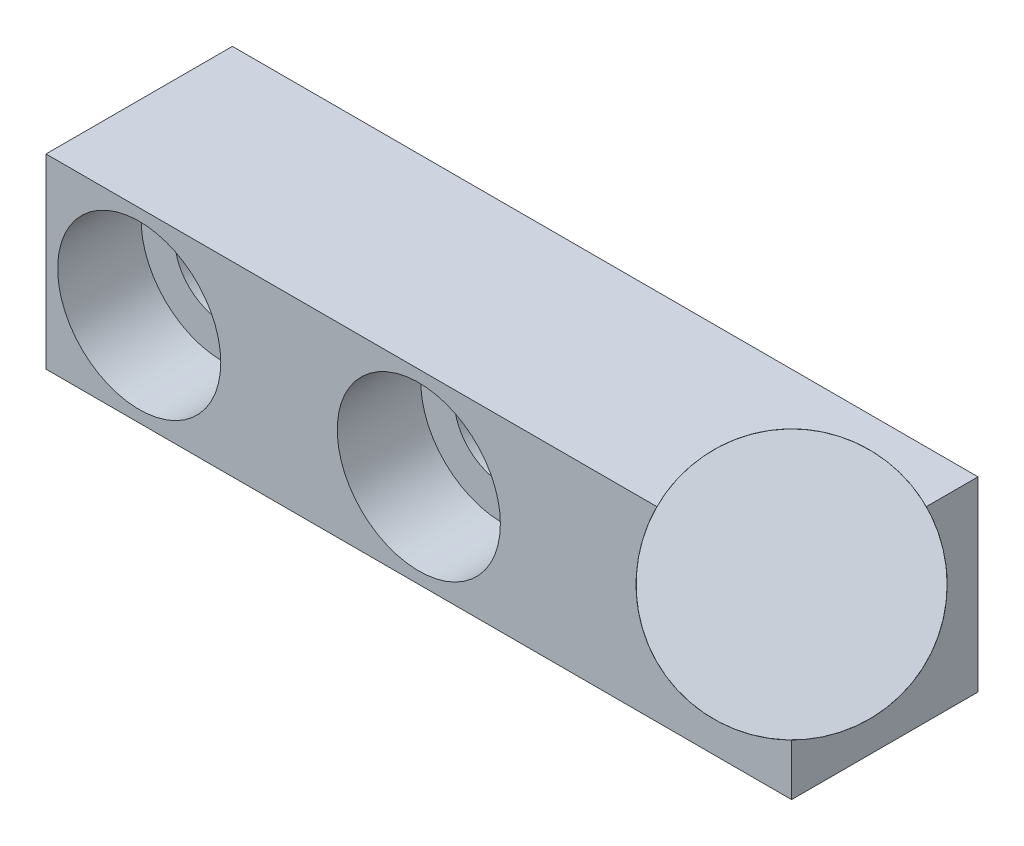
ISO-10303-21;
HEADER;
FILE_DESCRIPTION(('STEP AP214'),'2;1');
FILE_NAME('part.step','',(''),(''),'','','');
FILE_SCHEMA(('AUTOMOTIVE_DESIGN { 1 0 10303 214 1 1 1 1 }'));
ENDSEC;
DATA;
#1=APPLICATION_CONTEXT('core data for automotive mechanical design processes');
#2=APPLICATION_PROTOCOL_DEFINITION('international standard','automotive_design',2000,#1);
#3=PRODUCT_CONTEXT('',#1,'mechanical');
#4=PRODUCT('Part','Part','',(#3));
#5=PRODUCT_RELATED_PRODUCT_CATEGORY('part','',(#4));
#6=PRODUCT_DEFINITION_FORMATION('','',#4);
#7=PRODUCT_DEFINITION_CONTEXT('part definition',#1,'design');
#8=PRODUCT_DEFINITION('design','',#6,#7);
#9=PRODUCT_DEFINITION_SHAPE('','',#8);
#10=(LENGTH_UNIT() NAMED_UNIT(*) SI_UNIT(.MILLI.,.METRE.));
#11=(NAMED_UNIT(*) PLANE_ANGLE_UNIT() SI_UNIT($,.RADIAN.));
#12=(NAMED_UNIT(*) SI_UNIT($,.STERADIAN.) SOLID_ANGLE_UNIT());
#13=UNCERTAINTY_MEASURE_WITH_UNIT(LENGTH_MEASURE(1.E-05),#10,'distance_accuracy_value','');
#14=(GEOMETRIC_REPRESENTATION_CONTEXT(3) GLOBAL_UNCERTAINTY_ASSIGNED_CONTEXT((#13)) GLOBAL_UNIT_ASSIGNED_CONTEXT((#10,
#11,#12)) REPRESENTATION_CONTEXT('',''));
#15=CARTESIAN_POINT('',(0.,0.,0.));
#16=DIRECTION('',(0.,0.,1.));
#17=DIRECTION('',(1.,0.,0.));
#18=AXIS2_PLACEMENT_3D('',#15,#16,#17);
#19=CARTESIAN_POINT('',(-12.7,-3.175,6.35));
#20=DIRECTION('',(-1.,0.,0.));
#21=DIRECTION('',(0.,0.,1.));
#22=AXIS2_PLACEMENT_3D('',#19,#20,#21);
#23=PLANE('',#22);
#24=DIRECTION('',(0.,1.,0.));
#25=VECTOR('',#24,1.);
#26=CARTESIAN_POINT('',(-12.7,-3.175,0.));
#27=LINE('',#26,#25);
#28=CARTESIAN_POINT('',(-12.7,-3.175,0.));
#29=VERTEX_POINT('',#28);
#30=CARTESIAN_POINT('',(-12.7,3.175,0.));
#31=VERTEX_POINT('',#30);
#32=EDGE_CURVE('E121',#29,#31,#27,.T.);
#33=ORIENTED_EDGE('',*,*,#32,.F.);
#34=DIRECTION('',(0.,0.,-1.));
#35=VECTOR('',#34,1.);
#36=CARTESIAN_POINT('',(-12.7,-3.175,6.35));
#37=LINE('',#36,#35);
#38=CARTESIAN_POINT('',(-12.7,-3.175,6.35));
#39=VERTEX_POINT('',#38);
#40=EDGE_CURVE('E98',#39,#29,#37,.T.);
#41=ORIENTED_EDGE('',*,*,#40,.F.);
#42=DIRECTION('',(0.,1.,0.));
#43=VECTOR('',#42,1.);
#44=CARTESIAN_POINT('',(-12.7,-3.175,6.35));
#45=LINE('',#44,#43);
#46=CARTESIAN_POINT('',(-12.7,3.175,6.35));
#47=VERTEX_POINT('',#46);
#48=EDGE_CURVE('E139',#39,#47,#45,.T.);
#49=ORIENTED_EDGE('',*,*,#48,.T.);
#50=DIRECTION('',(0.,0.,-1.));
#51=VECTOR('',#50,1.);
#52=CARTESIAN_POINT('',(-12.7,3.175,6.35));
#53=LINE('',#52,#51);
#54=EDGE_CURVE('E146',#47,#31,#53,.T.);
#55=ORIENTED_EDGE('',*,*,#54,.T.);
#56=EDGE_LOOP('',(#33,#41,#49,#55));
#57=FACE_BOUND('',#56,.T.);
#58=ADVANCED_FACE('F33',(#57),#23,.T.);
#59=CARTESIAN_POINT('',(-12.7,-3.175,6.35));
#60=DIRECTION('',(0.,1.,0.));
#61=DIRECTION('',(0.,0.,1.));
#62=AXIS2_PLACEMENT_3D('',#59,#60,#61);
#63=PLANE('',#62);
#64=DIRECTION('',(0.707106781186547,0.,-0.707106781186548));
#65=VECTOR('',#64,1.);
#66=CARTESIAN_POINT('',(-1.77433518262806,-3.175,17.2756648173719));
#67=LINE('',#66,#65);
#68=CARTESIAN_POINT('',(10.7276035018956,-3.175,4.77372613284826));
#69=VERTEX_POINT('',#68);
#70=CARTESIAN_POINT('',(11.1237261328483,-3.175,4.3776035018956));
#71=VERTEX_POINT('',#70);
#72=EDGE_CURVE('E46',#69,#71,#67,.T.);
#73=ORIENTED_EDGE('',*,*,#72,.F.);
#74=CARTESIAN_POINT('',(6.35,-3.175,0.));
#75=DIRECTION('',(0.,1.,0.));
#76=DIRECTION('',(0.707106781186548,0.,0.707106781186547));
#77=AXIS2_PLACEMENT_3D('',#74,#75,#76);
#78=ELLIPSE('',#77,6.4891283505568,3.7465);
#79=EDGE_CURVE('E187',#69,#71,#78,.T.);
#80=ORIENTED_EDGE('',*,*,#79,.T.);
#81=EDGE_LOOP('',(#73,#80));
#82=FACE_BOUND('',#81,.T.);
#83=DIRECTION('',(1.,0.,0.));
#84=VECTOR('',#83,1.);
#85=CARTESIAN_POINT('',(-12.7,-3.175,0.));
#86=LINE('',#85,#84);
#87=CARTESIAN_POINT('',(12.7,-3.175,0.));
#88=VERTEX_POINT('',#87);
#89=EDGE_CURVE('E125',#29,#88,#86,.T.);
#90=ORIENTED_EDGE('',*,*,#89,.T.);
#91=DIRECTION('',(0.,0.,-1.));
#92=VECTOR('',#91,1.);
#93=CARTESIAN_POINT('',(12.7,-3.175,6.35));
#94=LINE('',#93,#92);
#95=CARTESIAN_POINT('',(12.7,-3.175,6.35));
#96=VERTEX_POINT('',#95);
#97=EDGE_CURVE('E141',#96,#88,#94,.T.);
#98=ORIENTED_EDGE('',*,*,#97,.F.);
#99=DIRECTION('',(1.,0.,0.));
#100=VECTOR('',#99,1.);
#101=CARTESIAN_POINT('',(-12.7,-3.175,6.35));
#102=LINE('',#101,#100);
#103=EDGE_CURVE('E133',#39,#96,#102,.T.);
#104=ORIENTED_EDGE('',*,*,#103,.F.);
#105=ORIENTED_EDGE('',*,*,#40,.T.);
#106=EDGE_LOOP('',(#90,#98,#104,#105));
#107=FACE_BOUND('',#106,.T.);
#108=ADVANCED_FACE('F181',(#82,#107),#63,.F.);
#109=CARTESIAN_POINT('',(12.7,-3.175,6.35));
#110=DIRECTION('',(-1.,0.,0.));
#111=DIRECTION('',(0.,0.,1.));
#112=AXIS2_PLACEMENT_3D('',#109,#110,#111);
#113=PLANE('',#112);
#114=DIRECTION('',(0.,0.,-1.));
#115=VECTOR('',#114,1.);
#116=CARTESIAN_POINT('',(12.7,3.175,6.35));
#117=LINE('',#116,#115);
#118=CARTESIAN_POINT('',(12.7,3.175,1.76149333933141));
#119=VERTEX_POINT('',#118);
#120=CARTESIAN_POINT('',(12.7,3.175,0.));
#121=VERTEX_POINT('',#120);
#122=EDGE_CURVE('E144',#119,#121,#117,.T.);
#123=ORIENTED_EDGE('',*,*,#122,.F.);
#124=CARTESIAN_POINT('',(12.7,3.175,6.35));
#125=DIRECTION('',(-1.,0.,0.));
#126=DIRECTION('',(0.,0.707106781186548,0.707106781186548));
#127=AXIS2_PLACEMENT_3D('',#124,#125,#126);
#128=ELLIPSE('',#127,6.4891283505568,3.7465);
#129=CARTESIAN_POINT('',(12.7,-1.41350666066859,6.35));
#130=VERTEX_POINT('',#129);
#131=EDGE_CURVE('E186',#119,#130,#128,.T.);
#132=ORIENTED_EDGE('',*,*,#131,.T.);
#133=DIRECTION('',(0.,1.,0.));
#134=VECTOR('',#133,1.);
#135=CARTESIAN_POINT('',(12.7,-3.175,6.35));
#136=LINE('',#135,#134);
#137=EDGE_CURVE('E172',#96,#130,#136,.T.);
#138=ORIENTED_EDGE('',*,*,#137,.F.);
#139=ORIENTED_EDGE('',*,*,#97,.T.);
#140=DIRECTION('',(0.,1.,0.));
#141=VECTOR('',#140,1.);
#142=CARTESIAN_POINT('',(12.7,-3.175,0.));
#143=LINE('',#142,#141);
#144=EDGE_CURVE('E128',#88,#121,#143,.T.);
#145=ORIENTED_EDGE('',*,*,#144,.T.);
#146=EDGE_LOOP('',(#123,#132,#138,#139,#145));
#147=FACE_BOUND('',#146,.T.);
#148=ADVANCED_FACE('F185',(#147),#113,.F.);
#149=CARTESIAN_POINT('',(-12.7,3.175,6.35));
#150=DIRECTION('',(0.,1.,0.));
#151=DIRECTION('',(0.,0.,1.));
#152=AXIS2_PLACEMENT_3D('',#149,#150,#151);
#153=PLANE('',#152);
#154=CARTESIAN_POINT('',(12.7,3.175,6.35));
#155=DIRECTION('',(0.,1.,0.));
#156=DIRECTION('',(0.707106781186548,0.,0.707106781186547));
#157=AXIS2_PLACEMENT_3D('',#154,#155,#156);
#158=ELLIPSE('',#157,6.4891283505568,3.7465);
#159=CARTESIAN_POINT('',(8.11149333933141,3.175,6.35));
#160=VERTEX_POINT('',#159);
#161=EDGE_CURVE('E54',#119,#160,#158,.T.);
#162=ORIENTED_EDGE('',*,*,#161,.F.);
#163=ORIENTED_EDGE('',*,*,#122,.T.);
#164=DIRECTION('',(1.,0.,0.));
#165=VECTOR('',#164,1.);
#166=CARTESIAN_POINT('',(-12.7,3.175,0.));
#167=LINE('',#166,#165);
#168=EDGE_CURVE('E124',#31,#121,#167,.T.);
#169=ORIENTED_EDGE('',*,*,#168,.F.);
#170=ORIENTED_EDGE('',*,*,#54,.F.);
#171=DIRECTION('',(1.,0.,0.));
#172=VECTOR('',#171,1.);
#173=CARTESIAN_POINT('',(-12.7,3.175,6.35));
#174=LINE('',#173,#172);
#175=EDGE_CURVE('E170',#47,#160,#174,.T.);
#176=ORIENTED_EDGE('',*,*,#175,.T.);
#177=EDGE_LOOP('',(#162,#163,#169,#170,#176));
#178=FACE_BOUND('',#177,.T.);
#179=ADVANCED_FACE('F200',(#178),#153,.T.);
#180=CARTESIAN_POINT('',(0.,0.,6.35));
#181=DIRECTION('',(0.,0.,-1.));
#182=DIRECTION('',(-1.,0.,0.));
#183=AXIS2_PLACEMENT_3D('',#180,#181,#182);
#184=PLANE('',#183);
#185=CARTESIAN_POINT('',(-9.525,0.,6.35));
#186=DIRECTION('',(0.,0.,1.));
#187=DIRECTION('',(1.,0.,0.));
#188=AXIS2_PLACEMENT_3D('',#185,#186,#187);
#189=CIRCLE('',#188,2.77875999999999);
#190=CARTESIAN_POINT('',(-6.74624000000001,0.,6.35));
#191=VERTEX_POINT('',#190);
#192=EDGE_CURVE('E160',#191,#191,#189,.T.);
#193=ORIENTED_EDGE('',*,*,#192,.F.);
#194=EDGE_LOOP('',(#193));
#195=FACE_BOUND('',#194,.T.);
#196=CARTESIAN_POINT('',(0.,0.,6.35));
#197=DIRECTION('',(0.,0.,1.));
#198=DIRECTION('',(1.,0.,0.));
#199=AXIS2_PLACEMENT_3D('',#196,#197,#198);
#200=CIRCLE('',#199,2.77875999999999);
#201=CARTESIAN_POINT('',(2.77875999999999,0.,6.35));
#202=VERTEX_POINT('',#201);
#203=EDGE_CURVE('E148',#202,#202,#200,.T.);
#204=ORIENTED_EDGE('',*,*,#203,.F.);
#205=EDGE_LOOP('',(#204));
#206=FACE_BOUND('',#205,.T.);
#207=ORIENTED_EDGE('',*,*,#137,.T.);
#208=CARTESIAN_POINT('',(12.7,3.175,6.35));
#209=DIRECTION('',(0.,0.,-1.));
#210=DIRECTION('',(0.707106781186548,0.707106781186547,0.));
#211=AXIS2_PLACEMENT_3D('',#208,#209,#210);
#212=ELLIPSE('',#211,6.4891283505568,3.7465);
#213=EDGE_CURVE('E190',#130,#160,#212,.T.);
#214=ORIENTED_EDGE('',*,*,#213,.T.);
#215=ORIENTED_EDGE('',*,*,#175,.F.);
#216=ORIENTED_EDGE('',*,*,#48,.F.);
#217=ORIENTED_EDGE('',*,*,#103,.T.);
#218=EDGE_LOOP('',(#207,#214,#215,#216,#217));
#219=FACE_BOUND('',#218,.T.);
#220=ADVANCED_FACE('F107',(#195,#206,#219),#184,.F.);
#221=CARTESIAN_POINT('',(0.,0.,0.));
#222=DIRECTION('',(0.,0.,-1.));
#223=DIRECTION('',(-1.,0.,0.));
#224=AXIS2_PLACEMENT_3D('',#221,#222,#223);
#225=PLANE('',#224);
#226=CARTESIAN_POINT('',(6.35,-3.175,0.));
#227=DIRECTION('',(0.,0.,-1.));
#228=DIRECTION('',(0.707106781186548,0.707106781186547,0.));
#229=AXIS2_PLACEMENT_3D('',#226,#227,#228);
#230=ELLIPSE('',#229,6.4891283505568,3.7465);
#231=CARTESIAN_POINT('',(10.7276035018956,1.59872613284829,0.));
#232=VERTEX_POINT('',#231);
#233=CARTESIAN_POINT('',(11.1237261328483,1.20260350189558,0.));
#234=VERTEX_POINT('',#233);
#235=EDGE_CURVE('E11',#232,#234,#230,.T.);
#236=ORIENTED_EDGE('',*,*,#235,.F.);
#237=DIRECTION('',(0.707106781186547,-0.707106781186548,0.));
#238=VECTOR('',#237,1.);
#239=CARTESIAN_POINT('',(6.16316481737193,6.16316481737193,0.));
#240=LINE('',#239,#238);
#241=EDGE_CURVE('E40',#232,#234,#240,.T.);
#242=ORIENTED_EDGE('',*,*,#241,.T.);
#243=EDGE_LOOP('',(#236,#242));
#244=FACE_BOUND('',#243,.T.);
#245=CARTESIAN_POINT('',(-9.525,0.,0.));
#246=DIRECTION('',(0.,0.,-1.));
#247=DIRECTION('',(-1.,0.,0.));
#248=AXIS2_PLACEMENT_3D('',#245,#246,#247);
#249=CIRCLE('',#248,1.63195);
#250=CARTESIAN_POINT('',(-11.15695,0.,0.));
#251=VERTEX_POINT('',#250);
#252=EDGE_CURVE('E112',#251,#251,#249,.T.);
#253=ORIENTED_EDGE('',*,*,#252,.F.);
#254=EDGE_LOOP('',(#253));
#255=FACE_BOUND('',#254,.T.);
#256=CARTESIAN_POINT('',(0.,0.,0.));
#257=DIRECTION('',(0.,0.,-1.));
#258=DIRECTION('',(-1.,0.,0.));
#259=AXIS2_PLACEMENT_3D('',#256,#257,#258);
#260=CIRCLE('',#259,1.63195);
#261=CARTESIAN_POINT('',(-1.63195,0.,0.));
#262=VERTEX_POINT('',#261);
#263=EDGE_CURVE('E116',#262,#262,#260,.T.);
#264=ORIENTED_EDGE('',*,*,#263,.F.);
#265=EDGE_LOOP('',(#264));
#266=FACE_BOUND('',#265,.T.);
#267=ORIENTED_EDGE('',*,*,#32,.T.);
#268=ORIENTED_EDGE('',*,*,#168,.T.);
#269=ORIENTED_EDGE('',*,*,#144,.F.);
#270=ORIENTED_EDGE('',*,*,#89,.F.);
#271=EDGE_LOOP('',(#267,#268,#269,#270));
#272=FACE_BOUND('',#271,.T.);
#273=ADVANCED_FACE('F103',(#244,#255,#266,#272),#225,.T.);
#274=CARTESIAN_POINT('',(0.,0.,6.35));
#275=DIRECTION('',(0.,0.,1.));
#276=DIRECTION('',(1.,0.,0.));
#277=AXIS2_PLACEMENT_3D('',#274,#275,#276);
#278=CYLINDRICAL_SURFACE('',#277,1.63195);
#279=ORIENTED_EDGE('',*,*,#263,.T.);
#280=EDGE_LOOP('',(#279));
#281=FACE_BOUND('',#280,.T.);
#282=CARTESIAN_POINT('',(0.,0.,3.5052));
#283=DIRECTION('',(0.,0.,1.));
#284=DIRECTION('',(1.,0.,0.));
#285=AXIS2_PLACEMENT_3D('',#282,#283,#284);
#286=CIRCLE('',#285,1.63195);
#287=CARTESIAN_POINT('',(1.63195,0.,3.5052));
#288=VERTEX_POINT('',#287);
#289=EDGE_CURVE('E130',#288,#288,#286,.T.);
#290=ORIENTED_EDGE('',*,*,#289,.T.);
#291=EDGE_LOOP('',(#290));
#292=FACE_BOUND('',#291,.T.);
#293=ADVANCED_FACE('F106',(#281,#292),#278,.F.);
#294=CARTESIAN_POINT('',(1.63195,0.,3.5052));
#295=DIRECTION('',(0.,0.,-1.));
#296=DIRECTION('',(-1.,0.,0.));
#297=AXIS2_PLACEMENT_3D('',#294,#295,#296);
#298=PLANE('',#297);
#299=ORIENTED_EDGE('',*,*,#289,.F.);
#300=EDGE_LOOP('',(#299));
#301=FACE_BOUND('',#300,.T.);
#302=CARTESIAN_POINT('',(0.,0.,3.5052));
#303=DIRECTION('',(0.,0.,1.));
#304=DIRECTION('',(1.,0.,0.));
#305=AXIS2_PLACEMENT_3D('',#302,#303,#304);
#306=CIRCLE('',#305,2.77876);
#307=CARTESIAN_POINT('',(2.77875999999999,0.,3.5052));
#308=VERTEX_POINT('',#307);
#309=EDGE_CURVE('E152',#308,#308,#306,.T.);
#310=ORIENTED_EDGE('',*,*,#309,.T.);
#311=EDGE_LOOP('',(#310));
#312=FACE_BOUND('',#311,.T.);
#313=ADVANCED_FACE('F207',(#301,#312),#298,.F.);
#314=CARTESIAN_POINT('',(0.,0.,6.35));
#315=DIRECTION('',(0.,0.,1.));
#316=DIRECTION('',(1.,0.,0.));
#317=AXIS2_PLACEMENT_3D('',#314,#315,#316);
#318=CYLINDRICAL_SURFACE('',#317,2.77876);
#319=ORIENTED_EDGE('',*,*,#309,.F.);
#320=EDGE_LOOP('',(#319));
#321=FACE_BOUND('',#320,.T.);
#322=ORIENTED_EDGE('',*,*,#203,.T.);
#323=EDGE_LOOP('',(#322));
#324=FACE_BOUND('',#323,.T.);
#325=ADVANCED_FACE('F204',(#321,#324),#318,.F.);
#326=CARTESIAN_POINT('',(-9.525,0.,6.35));
#327=DIRECTION('',(0.,0.,1.));
#328=DIRECTION('',(1.,0.,0.));
#329=AXIS2_PLACEMENT_3D('',#326,#327,#328);
#330=CYLINDRICAL_SURFACE('',#329,1.63195);
#331=ORIENTED_EDGE('',*,*,#252,.T.);
#332=EDGE_LOOP('',(#331));
#333=FACE_BOUND('',#332,.T.);
#334=CARTESIAN_POINT('',(-9.525,0.,3.5052));
#335=DIRECTION('',(0.,0.,1.));
#336=DIRECTION('',(1.,0.,0.));
#337=AXIS2_PLACEMENT_3D('',#334,#335,#336);
#338=CIRCLE('',#337,1.63195);
#339=CARTESIAN_POINT('',(-7.89305,0.,3.5052));
#340=VERTEX_POINT('',#339);
#341=EDGE_CURVE('E149',#340,#340,#338,.T.);
#342=ORIENTED_EDGE('',*,*,#341,.T.);
#343=EDGE_LOOP('',(#342));
#344=FACE_BOUND('',#343,.T.);
#345=ADVANCED_FACE('F206',(#333,#344),#330,.F.);
#346=CARTESIAN_POINT('',(-7.89305,0.,3.5052));
#347=DIRECTION('',(0.,0.,-1.));
#348=DIRECTION('',(-1.,0.,0.));
#349=AXIS2_PLACEMENT_3D('',#346,#347,#348);
#350=PLANE('',#349);
#351=ORIENTED_EDGE('',*,*,#341,.F.);
#352=EDGE_LOOP('',(#351));
#353=FACE_BOUND('',#352,.T.);
#354=CARTESIAN_POINT('',(-9.525,0.,3.5052));
#355=DIRECTION('',(0.,0.,1.));
#356=DIRECTION('',(1.,0.,0.));
#357=AXIS2_PLACEMENT_3D('',#354,#355,#356);
#358=CIRCLE('',#357,2.77876);
#359=CARTESIAN_POINT('',(-6.74624000000001,0.,3.5052));
#360=VERTEX_POINT('',#359);
#361=EDGE_CURVE('E155',#360,#360,#358,.T.);
#362=ORIENTED_EDGE('',*,*,#361,.T.);
#363=EDGE_LOOP('',(#362));
#364=FACE_BOUND('',#363,.T.);
#365=ADVANCED_FACE('F214',(#353,#364),#350,.F.);
#366=CARTESIAN_POINT('',(-9.525,0.,6.35));
#367=DIRECTION('',(0.,0.,1.));
#368=DIRECTION('',(1.,0.,0.));
#369=AXIS2_PLACEMENT_3D('',#366,#367,#368);
#370=CYLINDRICAL_SURFACE('',#369,2.77876);
#371=ORIENTED_EDGE('',*,*,#361,.F.);
#372=EDGE_LOOP('',(#371));
#373=FACE_BOUND('',#372,.T.);
#374=ORIENTED_EDGE('',*,*,#192,.T.);
#375=EDGE_LOOP('',(#374));
#376=FACE_BOUND('',#375,.T.);
#377=ADVANCED_FACE('F196',(#373,#376),#370,.F.);
#378=CARTESIAN_POINT('',(9.40044321158129,-0.124556788418711,3.05044321158129));
#379=DIRECTION('',(0.577350269189626,0.577350269189626,0.577350269189626));
#380=DIRECTION('',(0.707106781186547,0.,-0.707106781186548));
#381=AXIS2_PLACEMENT_3D('',#378,#379,#380);
#382=PLANE('',#381);
#383=ORIENTED_EDGE('',*,*,#241,.F.);
#384=CARTESIAN_POINT('',(9.40044321158129,-0.124556788418711,3.05044321158129));
#385=DIRECTION('',(0.577350269189626,0.577350269189626,0.577350269189626));
#386=DIRECTION('',(0.707106781186547,0.,-0.707106781186548));
#387=AXIS2_PLACEMENT_3D('',#384,#385,#386);
#388=CIRCLE('',#387,3.7465);
#389=EDGE_CURVE('E95',#234,#232,#388,.T.);
#390=ORIENTED_EDGE('',*,*,#389,.F.);
#391=EDGE_LOOP('',(#383,#390));
#392=FACE_BOUND('',#391,.T.);
#393=ADVANCED_FACE('F94',(#392),#382,.F.);
#394=CARTESIAN_POINT('',(9.40044321158129,-0.124556788418711,3.05044321158129));
#395=DIRECTION('',(0.577350269189626,0.577350269189626,0.577350269189626));
#396=DIRECTION('',(0.707106781186547,0.,-0.707106781186548));
#397=AXIS2_PLACEMENT_3D('',#394,#395,#396);
#398=CYLINDRICAL_SURFACE('',#397,3.7465);
#399=ORIENTED_EDGE('',*,*,#389,.T.);
#400=ORIENTED_EDGE('',*,*,#235,.T.);
#401=EDGE_LOOP('',(#399,#400));
#402=FACE_BOUND('',#401,.T.);
#403=ADVANCED_FACE('F100',(#402),#398,.T.);
#404=CARTESIAN_POINT('',(12.7,3.175,6.35));
#405=DIRECTION('',(0.577350269189626,0.577350269189626,0.577350269189626));
#406=DIRECTION('',(0.707106781186547,0.,-0.707106781186548));
#407=AXIS2_PLACEMENT_3D('',#404,#405,#406);
#408=PLANE('',#407);
#409=CARTESIAN_POINT('',(12.7,3.175,6.35));
#410=VERTEX_POINT('',#409);
#411=VERTEX_LOOP('',#410);
#412=FACE_BOUND('',#411,.T.);
#413=CARTESIAN_POINT('',(12.7,3.175,6.35));
#414=DIRECTION('',(0.577350269189626,0.577350269189626,0.577350269189626));
#415=DIRECTION('',(0.707106781186547,0.,-0.707106781186548));
#416=AXIS2_PLACEMENT_3D('',#413,#414,#415);
#417=CIRCLE('',#416,3.7465);
#418=CARTESIAN_POINT('',(15.3491755557154,3.175,3.7008244442846));
#419=VERTEX_POINT('',#418);
#420=EDGE_CURVE('E234',#419,#419,#417,.T.);
#421=ORIENTED_EDGE('',*,*,#420,.T.);
#422=EDGE_LOOP('',(#421));
#423=FACE_BOUND('',#422,.T.);
#424=ADVANCED_FACE('F257',(#412,#423),#408,.T.);
#425=ORIENTED_EDGE('',*,*,#420,.F.);
#426=EDGE_LOOP('',(#425));
#427=FACE_BOUND('',#426,.T.);
#428=ORIENTED_EDGE('',*,*,#131,.F.);
#429=ORIENTED_EDGE('',*,*,#161,.T.);
#430=ORIENTED_EDGE('',*,*,#213,.F.);
#431=EDGE_LOOP('',(#428,#429,#430));
#432=FACE_BOUND('',#431,.T.);
#433=ADVANCED_FACE('F249',(#427,#432),#398,.T.);
#434=ORIENTED_EDGE('',*,*,#79,.F.);
#435=EDGE_CURVE('E101',#69,#71,#388,.T.);
#436=ORIENTED_EDGE('',*,*,#435,.T.);
#437=EDGE_LOOP('',(#434,#436));
#438=FACE_BOUND('',#437,.T.);
#439=ADVANCED_FACE('F241',(#438),#398,.T.);
#440=ORIENTED_EDGE('',*,*,#435,.F.);
#441=ORIENTED_EDGE('',*,*,#72,.T.);
#442=EDGE_LOOP('',(#440,#441));
#443=FACE_BOUND('',#442,.T.);
#444=ADVANCED_FACE('F243',(#443),#382,.F.);
#445=CLOSED_SHELL('',(#58,#108,#148,#179,#220,#273,#293,#313,#325,#345,#365,#377,#393,#403,#424,
#433,#439,#444));
#446=MANIFOLD_SOLID_BREP('B2',#445);
#447=ADVANCED_BREP_SHAPE_REPRESENTATION('',(#18,#446),#14);
#448=SHAPE_DEFINITION_REPRESENTATION(#9,#447);
ENDSEC;
END-ISO-10303-21;
